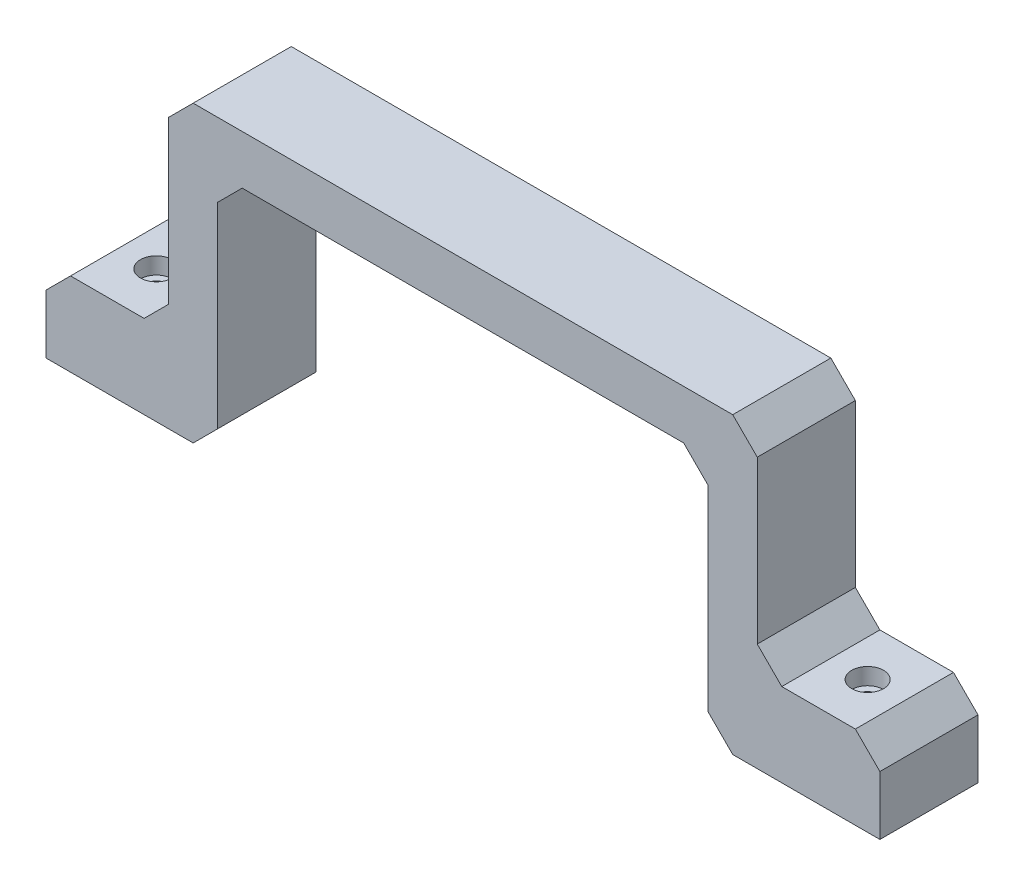
ISO-10303-21;
HEADER;
FILE_DESCRIPTION(('STEP AP214'),'2;1');
FILE_NAME('part.step','',(''),(''),'','','');
FILE_SCHEMA(('AUTOMOTIVE_DESIGN { 1 0 10303 214 1 1 1 1 }'));
ENDSEC;
DATA;
#1=APPLICATION_CONTEXT('core data for automotive mechanical design processes');
#2=APPLICATION_PROTOCOL_DEFINITION('international standard','automotive_design',2000,#1);
#3=PRODUCT_CONTEXT('',#1,'mechanical');
#4=PRODUCT('Part','Part','',(#3));
#5=PRODUCT_RELATED_PRODUCT_CATEGORY('part','',(#4));
#6=PRODUCT_DEFINITION_FORMATION('','',#4);
#7=PRODUCT_DEFINITION_CONTEXT('part definition',#1,'design');
#8=PRODUCT_DEFINITION('design','',#6,#7);
#9=PRODUCT_DEFINITION_SHAPE('','',#8);
#10=(LENGTH_UNIT() NAMED_UNIT(*) SI_UNIT(.MILLI.,.METRE.));
#11=(NAMED_UNIT(*) PLANE_ANGLE_UNIT() SI_UNIT($,.RADIAN.));
#12=(NAMED_UNIT(*) SI_UNIT($,.STERADIAN.) SOLID_ANGLE_UNIT());
#13=UNCERTAINTY_MEASURE_WITH_UNIT(LENGTH_MEASURE(1.E-05),#10,'distance_accuracy_value','');
#14=(GEOMETRIC_REPRESENTATION_CONTEXT(3) GLOBAL_UNCERTAINTY_ASSIGNED_CONTEXT((#13)) GLOBAL_UNIT_ASSIGNED_CONTEXT((#10,
#11,#12)) REPRESENTATION_CONTEXT('',''));
#15=CARTESIAN_POINT('',(0.,0.,0.));
#16=DIRECTION('',(0.,0.,1.));
#17=DIRECTION('',(1.,0.,0.));
#18=AXIS2_PLACEMENT_3D('',#15,#16,#17);
#19=CARTESIAN_POINT('',(25.,38.,20.));
#20=DIRECTION('',(-0.707106781186547,0.707106781186548,0.));
#21=DIRECTION('',(-0.707106781186548,-0.707106781186547,0.));
#22=AXIS2_PLACEMENT_3D('',#19,#20,#21);
#23=PLANE('',#22);
#24=DIRECTION('',(0.707106781186548,0.707106781186547,0.));
#25=VECTOR('',#24,1.);
#26=CARTESIAN_POINT('',(25.,38.,0.));
#27=LINE('',#26,#25);
#28=CARTESIAN_POINT('',(25.,38.,0.));
#29=VERTEX_POINT('',#28);
#30=CARTESIAN_POINT('',(30.,43.,0.));
#31=VERTEX_POINT('',#30);
#32=EDGE_CURVE('E231',#29,#31,#27,.T.);
#33=ORIENTED_EDGE('',*,*,#32,.F.);
#34=DIRECTION('',(0.,0.,-1.));
#35=VECTOR('',#34,1.);
#36=CARTESIAN_POINT('',(25.,38.,20.));
#37=LINE('',#36,#35);
#38=CARTESIAN_POINT('',(25.,38.,20.));
#39=VERTEX_POINT('',#38);
#40=EDGE_CURVE('E11',#39,#29,#37,.T.);
#41=ORIENTED_EDGE('',*,*,#40,.F.);
#42=DIRECTION('',(0.707106781186548,0.707106781186547,0.));
#43=VECTOR('',#42,1.);
#44=CARTESIAN_POINT('',(25.,38.,20.));
#45=LINE('',#44,#43);
#46=CARTESIAN_POINT('',(30.,43.,20.));
#47=VERTEX_POINT('',#46);
#48=EDGE_CURVE('E316',#39,#47,#45,.T.);
#49=ORIENTED_EDGE('',*,*,#48,.T.);
#50=DIRECTION('',(0.,0.,-1.));
#51=VECTOR('',#50,1.);
#52=CARTESIAN_POINT('',(30.,43.,20.));
#53=LINE('',#52,#51);
#54=EDGE_CURVE('E47',#47,#31,#53,.T.);
#55=ORIENTED_EDGE('',*,*,#54,.T.);
#56=EDGE_LOOP('',(#33,#41,#49,#55));
#57=FACE_BOUND('',#56,.T.);
#58=ADVANCED_FACE('F44',(#57),#23,.T.);
#59=CARTESIAN_POINT('',(25.,5.,20.));
#60=DIRECTION('',(-1.,0.,0.));
#61=DIRECTION('',(0.,0.,1.));
#62=AXIS2_PLACEMENT_3D('',#59,#60,#61);
#63=PLANE('',#62);
#64=DIRECTION('',(0.,1.,0.));
#65=VECTOR('',#64,1.);
#66=CARTESIAN_POINT('',(25.,5.,0.));
#67=LINE('',#66,#65);
#68=CARTESIAN_POINT('',(25.,5.,0.));
#69=VERTEX_POINT('',#68);
#70=EDGE_CURVE('E313',#69,#29,#67,.T.);
#71=ORIENTED_EDGE('',*,*,#70,.F.);
#72=DIRECTION('',(0.,0.,-1.));
#73=VECTOR('',#72,1.);
#74=CARTESIAN_POINT('',(25.,5.,20.));
#75=LINE('',#74,#73);
#76=CARTESIAN_POINT('',(25.,5.,20.));
#77=VERTEX_POINT('',#76);
#78=EDGE_CURVE('E54',#77,#69,#75,.T.);
#79=ORIENTED_EDGE('',*,*,#78,.F.);
#80=DIRECTION('',(0.,1.,0.));
#81=VECTOR('',#80,1.);
#82=CARTESIAN_POINT('',(25.,5.,20.));
#83=LINE('',#82,#81);
#84=EDGE_CURVE('E217',#77,#39,#83,.T.);
#85=ORIENTED_EDGE('',*,*,#84,.T.);
#86=ORIENTED_EDGE('',*,*,#40,.T.);
#87=EDGE_LOOP('',(#71,#79,#85,#86));
#88=FACE_BOUND('',#87,.T.);
#89=ADVANCED_FACE('F376',(#88),#63,.T.);
#90=CARTESIAN_POINT('',(20.,0.,20.));
#91=DIRECTION('',(-0.707106781186547,0.707106781186548,0.));
#92=DIRECTION('',(-0.707106781186548,-0.707106781186547,0.));
#93=AXIS2_PLACEMENT_3D('',#90,#91,#92);
#94=PLANE('',#93);
#95=DIRECTION('',(0.707106781186548,0.707106781186547,0.));
#96=VECTOR('',#95,1.);
#97=CARTESIAN_POINT('',(20.,0.,0.));
#98=LINE('',#97,#96);
#99=CARTESIAN_POINT('',(20.,0.,0.));
#100=VERTEX_POINT('',#99);
#101=EDGE_CURVE('E203',#100,#69,#98,.T.);
#102=ORIENTED_EDGE('',*,*,#101,.F.);
#103=DIRECTION('',(0.,0.,-1.));
#104=VECTOR('',#103,1.);
#105=CARTESIAN_POINT('',(20.,0.,20.));
#106=LINE('',#105,#104);
#107=CARTESIAN_POINT('',(20.,0.,20.));
#108=VERTEX_POINT('',#107);
#109=EDGE_CURVE('E198',#108,#100,#106,.T.);
#110=ORIENTED_EDGE('',*,*,#109,.F.);
#111=DIRECTION('',(0.707106781186548,0.707106781186547,0.));
#112=VECTOR('',#111,1.);
#113=CARTESIAN_POINT('',(20.,0.,20.));
#114=LINE('',#113,#112);
#115=EDGE_CURVE('E201',#108,#77,#114,.T.);
#116=ORIENTED_EDGE('',*,*,#115,.T.);
#117=ORIENTED_EDGE('',*,*,#78,.T.);
#118=EDGE_LOOP('',(#102,#110,#116,#117));
#119=FACE_BOUND('',#118,.T.);
#120=ADVANCED_FACE('F200',(#119),#94,.T.);
#121=CARTESIAN_POINT('',(5.,0.,20.));
#122=DIRECTION('',(0.,1.,0.));
#123=DIRECTION('',(0.,0.,1.));
#124=AXIS2_PLACEMENT_3D('',#121,#122,#123);
#125=PLANE('',#124);
#126=CARTESIAN_POINT('',(12.5,0.,10.));
#127=DIRECTION('',(0.,1.,0.));
#128=DIRECTION('',(0.,0.,1.));
#129=AXIS2_PLACEMENT_3D('',#126,#127,#128);
#130=CIRCLE('',#129,3.25);
#131=CARTESIAN_POINT('',(12.5,0.,13.25));
#132=VERTEX_POINT('',#131);
#133=EDGE_CURVE('E510',#132,#132,#130,.T.);
#134=ORIENTED_EDGE('',*,*,#133,.F.);
#135=EDGE_LOOP('',(#134));
#136=FACE_BOUND('',#135,.T.);
#137=DIRECTION('',(1.,0.,0.));
#138=VECTOR('',#137,1.);
#139=CARTESIAN_POINT('',(5.,0.,0.));
#140=LINE('',#139,#138);
#141=CARTESIAN_POINT('',(5.,0.,0.));
#142=VERTEX_POINT('',#141);
#143=EDGE_CURVE('E308',#142,#100,#140,.T.);
#144=ORIENTED_EDGE('',*,*,#143,.F.);
#145=DIRECTION('',(0.,0.,-1.));
#146=VECTOR('',#145,1.);
#147=CARTESIAN_POINT('',(5.,0.,20.));
#148=LINE('',#147,#146);
#149=CARTESIAN_POINT('',(5.,0.,20.));
#150=VERTEX_POINT('',#149);
#151=EDGE_CURVE('E209',#150,#142,#148,.T.);
#152=ORIENTED_EDGE('',*,*,#151,.F.);
#153=DIRECTION('',(1.,0.,0.));
#154=VECTOR('',#153,1.);
#155=CARTESIAN_POINT('',(5.,0.,20.));
#156=LINE('',#155,#154);
#157=EDGE_CURVE('E215',#150,#108,#156,.T.);
#158=ORIENTED_EDGE('',*,*,#157,.T.);
#159=ORIENTED_EDGE('',*,*,#109,.T.);
#160=EDGE_LOOP('',(#144,#152,#158,#159));
#161=FACE_BOUND('',#160,.T.);
#162=ADVANCED_FACE('F220',(#136,#161),#125,.T.);
#163=CARTESIAN_POINT('',(0.,-5.,20.));
#164=DIRECTION('',(-0.707106781186548,0.707106781186548,0.));
#165=DIRECTION('',(-0.707106781186548,-0.707106781186548,0.));
#166=AXIS2_PLACEMENT_3D('',#163,#164,#165);
#167=PLANE('',#166);
#168=DIRECTION('',(0.707106781186548,0.707106781186548,0.));
#169=VECTOR('',#168,1.);
#170=CARTESIAN_POINT('',(0.,-5.,0.));
#171=LINE('',#170,#169);
#172=CARTESIAN_POINT('',(0.,-5.,0.));
#173=VERTEX_POINT('',#172);
#174=EDGE_CURVE('E304',#173,#142,#171,.T.);
#175=ORIENTED_EDGE('',*,*,#174,.F.);
#176=DIRECTION('',(0.,0.,-1.));
#177=VECTOR('',#176,1.);
#178=CARTESIAN_POINT('',(0.,-5.,20.));
#179=LINE('',#178,#177);
#180=CARTESIAN_POINT('',(0.,-5.,20.));
#181=VERTEX_POINT('',#180);
#182=EDGE_CURVE('E322',#181,#173,#179,.T.);
#183=ORIENTED_EDGE('',*,*,#182,.F.);
#184=DIRECTION('',(0.707106781186548,0.707106781186548,0.));
#185=VECTOR('',#184,1.);
#186=CARTESIAN_POINT('',(0.,-5.,20.));
#187=LINE('',#186,#185);
#188=EDGE_CURVE('E222',#181,#150,#187,.T.);
#189=ORIENTED_EDGE('',*,*,#188,.T.);
#190=ORIENTED_EDGE('',*,*,#151,.T.);
#191=EDGE_LOOP('',(#175,#183,#189,#190));
#192=FACE_BOUND('',#191,.T.);
#193=ADVANCED_FACE('F389',(#192),#167,.T.);
#194=CARTESIAN_POINT('',(0.,-17.,20.));
#195=DIRECTION('',(-1.,0.,0.));
#196=DIRECTION('',(0.,0.,1.));
#197=AXIS2_PLACEMENT_3D('',#194,#195,#196);
#198=PLANE('',#197);
#199=DIRECTION('',(0.,1.,0.));
#200=VECTOR('',#199,1.);
#201=CARTESIAN_POINT('',(0.,-17.,0.));
#202=LINE('',#201,#200);
#203=CARTESIAN_POINT('',(0.,-17.,0.));
#204=VERTEX_POINT('',#203);
#205=EDGE_CURVE('E300',#204,#173,#202,.T.);
#206=ORIENTED_EDGE('',*,*,#205,.F.);
#207=DIRECTION('',(0.,0.,-1.));
#208=VECTOR('',#207,1.);
#209=CARTESIAN_POINT('',(0.,-17.,20.));
#210=LINE('',#209,#208);
#211=CARTESIAN_POINT('',(0.,-17.,20.));
#212=VERTEX_POINT('',#211);
#213=EDGE_CURVE('E325',#212,#204,#210,.T.);
#214=ORIENTED_EDGE('',*,*,#213,.F.);
#215=DIRECTION('',(0.,1.,0.));
#216=VECTOR('',#215,1.);
#217=CARTESIAN_POINT('',(0.,-17.,20.));
#218=LINE('',#217,#216);
#219=EDGE_CURVE('E225',#212,#181,#218,.T.);
#220=ORIENTED_EDGE('',*,*,#219,.T.);
#221=ORIENTED_EDGE('',*,*,#182,.T.);
#222=EDGE_LOOP('',(#206,#214,#220,#221));
#223=FACE_BOUND('',#222,.T.);
#224=ADVANCED_FACE('F393',(#223),#198,.T.);
#225=CARTESIAN_POINT('',(30.,-17.,20.));
#226=DIRECTION('',(0.,-1.,0.));
#227=DIRECTION('',(0.,0.,-1.));
#228=AXIS2_PLACEMENT_3D('',#225,#226,#227);
#229=PLANE('',#228);
#230=CARTESIAN_POINT('',(12.5,-17.,10.));
#231=DIRECTION('',(0.,-1.,0.));
#232=DIRECTION('',(0.,0.,-1.));
#233=AXIS2_PLACEMENT_3D('',#230,#231,#232);
#234=CIRCLE('',#233,1.8);
#235=CARTESIAN_POINT('',(12.5,-17.,8.2));
#236=VERTEX_POINT('',#235);
#237=EDGE_CURVE('E236',#236,#236,#234,.T.);
#238=ORIENTED_EDGE('',*,*,#237,.F.);
#239=EDGE_LOOP('',(#238));
#240=FACE_BOUND('',#239,.T.);
#241=DIRECTION('',(-1.,0.,0.));
#242=VECTOR('',#241,1.);
#243=CARTESIAN_POINT('',(30.,-17.,0.));
#244=LINE('',#243,#242);
#245=CARTESIAN_POINT('',(30.,-17.,0.));
#246=VERTEX_POINT('',#245);
#247=EDGE_CURVE('E296',#246,#204,#244,.T.);
#248=ORIENTED_EDGE('',*,*,#247,.F.);
#249=DIRECTION('',(0.,0.,-1.));
#250=VECTOR('',#249,1.);
#251=CARTESIAN_POINT('',(30.,-17.,20.));
#252=LINE('',#251,#250);
#253=CARTESIAN_POINT('',(30.,-17.,20.));
#254=VERTEX_POINT('',#253);
#255=EDGE_CURVE('E328',#254,#246,#252,.T.);
#256=ORIENTED_EDGE('',*,*,#255,.F.);
#257=DIRECTION('',(-1.,0.,0.));
#258=VECTOR('',#257,1.);
#259=CARTESIAN_POINT('',(30.,-17.,20.));
#260=LINE('',#259,#258);
#261=EDGE_CURVE('E586',#254,#212,#260,.T.);
#262=ORIENTED_EDGE('',*,*,#261,.T.);
#263=ORIENTED_EDGE('',*,*,#213,.T.);
#264=EDGE_LOOP('',(#248,#256,#262,#263));
#265=FACE_BOUND('',#264,.T.);
#266=ADVANCED_FACE('F397',(#240,#265),#229,.T.);
#267=CARTESIAN_POINT('',(35.,-12.,20.));
#268=DIRECTION('',(0.707106781186547,-0.707106781186548,0.));
#269=DIRECTION('',(0.707106781186548,0.707106781186547,0.));
#270=AXIS2_PLACEMENT_3D('',#267,#268,#269);
#271=PLANE('',#270);
#272=DIRECTION('',(-0.707106781186548,-0.707106781186547,0.));
#273=VECTOR('',#272,1.);
#274=CARTESIAN_POINT('',(35.,-12.,0.));
#275=LINE('',#274,#273);
#276=CARTESIAN_POINT('',(35.,-12.,0.));
#277=VERTEX_POINT('',#276);
#278=EDGE_CURVE('E292',#277,#246,#275,.T.);
#279=ORIENTED_EDGE('',*,*,#278,.F.);
#280=DIRECTION('',(0.,0.,-1.));
#281=VECTOR('',#280,1.);
#282=CARTESIAN_POINT('',(35.,-12.,20.));
#283=LINE('',#282,#281);
#284=CARTESIAN_POINT('',(35.,-12.,20.));
#285=VERTEX_POINT('',#284);
#286=EDGE_CURVE('E331',#285,#277,#283,.T.);
#287=ORIENTED_EDGE('',*,*,#286,.F.);
#288=DIRECTION('',(-0.707106781186548,-0.707106781186547,0.));
#289=VECTOR('',#288,1.);
#290=CARTESIAN_POINT('',(35.,-12.,20.));
#291=LINE('',#290,#289);
#292=EDGE_CURVE('E582',#285,#254,#291,.T.);
#293=ORIENTED_EDGE('',*,*,#292,.T.);
#294=ORIENTED_EDGE('',*,*,#255,.T.);
#295=EDGE_LOOP('',(#279,#287,#293,#294));
#296=FACE_BOUND('',#295,.T.);
#297=ADVANCED_FACE('F401',(#296),#271,.T.);
#298=CARTESIAN_POINT('',(35.,28.,20.));
#299=DIRECTION('',(1.,0.,0.));
#300=DIRECTION('',(0.,1.,0.));
#301=AXIS2_PLACEMENT_3D('',#298,#299,#300);
#302=PLANE('',#301);
#303=DIRECTION('',(0.,-1.,0.));
#304=VECTOR('',#303,1.);
#305=CARTESIAN_POINT('',(35.,28.,0.));
#306=LINE('',#305,#304);
#307=CARTESIAN_POINT('',(35.,28.,0.));
#308=VERTEX_POINT('',#307);
#309=EDGE_CURVE('E288',#308,#277,#306,.T.);
#310=ORIENTED_EDGE('',*,*,#309,.F.);
#311=DIRECTION('',(0.,0.,-1.));
#312=VECTOR('',#311,1.);
#313=CARTESIAN_POINT('',(35.,28.,20.));
#314=LINE('',#313,#312);
#315=CARTESIAN_POINT('',(35.,28.,20.));
#316=VERTEX_POINT('',#315);
#317=EDGE_CURVE('E334',#316,#308,#314,.T.);
#318=ORIENTED_EDGE('',*,*,#317,.F.);
#319=DIRECTION('',(0.,-1.,0.));
#320=VECTOR('',#319,1.);
#321=CARTESIAN_POINT('',(35.,28.,20.));
#322=LINE('',#321,#320);
#323=EDGE_CURVE('E578',#316,#285,#322,.T.);
#324=ORIENTED_EDGE('',*,*,#323,.T.);
#325=ORIENTED_EDGE('',*,*,#286,.T.);
#326=EDGE_LOOP('',(#310,#318,#324,#325));
#327=FACE_BOUND('',#326,.T.);
#328=ADVANCED_FACE('F405',(#327),#302,.T.);
#329=CARTESIAN_POINT('',(40.,33.,20.));
#330=DIRECTION('',(0.707106781186548,-0.707106781186548,0.));
#331=DIRECTION('',(0.707106781186548,0.707106781186548,0.));
#332=AXIS2_PLACEMENT_3D('',#329,#330,#331);
#333=PLANE('',#332);
#334=DIRECTION('',(-0.707106781186547,-0.707106781186547,0.));
#335=VECTOR('',#334,1.);
#336=CARTESIAN_POINT('',(40.,33.,0.));
#337=LINE('',#336,#335);
#338=CARTESIAN_POINT('',(40.,33.,0.));
#339=VERTEX_POINT('',#338);
#340=EDGE_CURVE('E284',#339,#308,#337,.T.);
#341=ORIENTED_EDGE('',*,*,#340,.F.);
#342=DIRECTION('',(0.,0.,-1.));
#343=VECTOR('',#342,1.);
#344=CARTESIAN_POINT('',(40.,33.,20.));
#345=LINE('',#344,#343);
#346=CARTESIAN_POINT('',(40.,33.,20.));
#347=VERTEX_POINT('',#346);
#348=EDGE_CURVE('E337',#347,#339,#345,.T.);
#349=ORIENTED_EDGE('',*,*,#348,.F.);
#350=DIRECTION('',(-0.707106781186547,-0.707106781186547,0.));
#351=VECTOR('',#350,1.);
#352=CARTESIAN_POINT('',(40.,33.,20.));
#353=LINE('',#352,#351);
#354=EDGE_CURVE('E574',#347,#316,#353,.T.);
#355=ORIENTED_EDGE('',*,*,#354,.T.);
#356=ORIENTED_EDGE('',*,*,#317,.T.);
#357=EDGE_LOOP('',(#341,#349,#355,#356));
#358=FACE_BOUND('',#357,.T.);
#359=ADVANCED_FACE('F409',(#358),#333,.T.);
#360=CARTESIAN_POINT('',(130.,33.,20.));
#361=DIRECTION('',(0.,-1.,0.));
#362=DIRECTION('',(1.,0.,0.));
#363=AXIS2_PLACEMENT_3D('',#360,#361,#362);
#364=PLANE('',#363);
#365=DIRECTION('',(-1.,0.,0.));
#366=VECTOR('',#365,1.);
#367=CARTESIAN_POINT('',(130.,33.,0.));
#368=LINE('',#367,#366);
#369=CARTESIAN_POINT('',(130.,33.,0.));
#370=VERTEX_POINT('',#369);
#371=EDGE_CURVE('E280',#370,#339,#368,.T.);
#372=ORIENTED_EDGE('',*,*,#371,.F.);
#373=DIRECTION('',(0.,0.,-1.));
#374=VECTOR('',#373,1.);
#375=CARTESIAN_POINT('',(130.,33.,20.));
#376=LINE('',#375,#374);
#377=CARTESIAN_POINT('',(130.,33.,20.));
#378=VERTEX_POINT('',#377);
#379=EDGE_CURVE('E340',#378,#370,#376,.T.);
#380=ORIENTED_EDGE('',*,*,#379,.F.);
#381=DIRECTION('',(-1.,0.,0.));
#382=VECTOR('',#381,1.);
#383=CARTESIAN_POINT('',(130.,33.,20.));
#384=LINE('',#383,#382);
#385=EDGE_CURVE('E570',#378,#347,#384,.T.);
#386=ORIENTED_EDGE('',*,*,#385,.T.);
#387=ORIENTED_EDGE('',*,*,#348,.T.);
#388=EDGE_LOOP('',(#372,#380,#386,#387));
#389=FACE_BOUND('',#388,.T.);
#390=ADVANCED_FACE('F413',(#389),#364,.T.);
#391=CARTESIAN_POINT('',(135.,28.,20.));
#392=DIRECTION('',(-0.707106781186547,-0.707106781186548,0.));
#393=DIRECTION('',(0.707106781186548,-0.707106781186547,0.));
#394=AXIS2_PLACEMENT_3D('',#391,#392,#393);
#395=PLANE('',#394);
#396=DIRECTION('',(-0.707106781186548,0.707106781186547,0.));
#397=VECTOR('',#396,1.);
#398=CARTESIAN_POINT('',(135.,28.,0.));
#399=LINE('',#398,#397);
#400=CARTESIAN_POINT('',(135.,28.,0.));
#401=VERTEX_POINT('',#400);
#402=EDGE_CURVE('E276',#401,#370,#399,.T.);
#403=ORIENTED_EDGE('',*,*,#402,.F.);
#404=DIRECTION('',(0.,0.,-1.));
#405=VECTOR('',#404,1.);
#406=CARTESIAN_POINT('',(135.,28.,20.));
#407=LINE('',#406,#405);
#408=CARTESIAN_POINT('',(135.,28.,20.));
#409=VERTEX_POINT('',#408);
#410=EDGE_CURVE('E343',#409,#401,#407,.T.);
#411=ORIENTED_EDGE('',*,*,#410,.F.);
#412=DIRECTION('',(-0.707106781186548,0.707106781186547,0.));
#413=VECTOR('',#412,1.);
#414=CARTESIAN_POINT('',(135.,28.,20.));
#415=LINE('',#414,#413);
#416=EDGE_CURVE('E566',#409,#378,#415,.T.);
#417=ORIENTED_EDGE('',*,*,#416,.T.);
#418=ORIENTED_EDGE('',*,*,#379,.T.);
#419=EDGE_LOOP('',(#403,#411,#417,#418));
#420=FACE_BOUND('',#419,.T.);
#421=ADVANCED_FACE('F417',(#420),#395,.T.);
#422=CARTESIAN_POINT('',(135.,-12.,20.));
#423=DIRECTION('',(-1.,0.,0.));
#424=DIRECTION('',(0.,0.,1.));
#425=AXIS2_PLACEMENT_3D('',#422,#423,#424);
#426=PLANE('',#425);
#427=DIRECTION('',(0.,1.,0.));
#428=VECTOR('',#427,1.);
#429=CARTESIAN_POINT('',(135.,-12.,0.));
#430=LINE('',#429,#428);
#431=CARTESIAN_POINT('',(135.,-12.,0.));
#432=VERTEX_POINT('',#431);
#433=EDGE_CURVE('E272',#432,#401,#430,.T.);
#434=ORIENTED_EDGE('',*,*,#433,.F.);
#435=DIRECTION('',(0.,0.,-1.));
#436=VECTOR('',#435,1.);
#437=CARTESIAN_POINT('',(135.,-12.,20.));
#438=LINE('',#437,#436);
#439=CARTESIAN_POINT('',(135.,-12.,20.));
#440=VERTEX_POINT('',#439);
#441=EDGE_CURVE('E346',#440,#432,#438,.T.);
#442=ORIENTED_EDGE('',*,*,#441,.F.);
#443=DIRECTION('',(0.,1.,0.));
#444=VECTOR('',#443,1.);
#445=CARTESIAN_POINT('',(135.,-12.,20.));
#446=LINE('',#445,#444);
#447=EDGE_CURVE('E562',#440,#409,#446,.T.);
#448=ORIENTED_EDGE('',*,*,#447,.T.);
#449=ORIENTED_EDGE('',*,*,#410,.T.);
#450=EDGE_LOOP('',(#434,#442,#448,#449));
#451=FACE_BOUND('',#450,.T.);
#452=ADVANCED_FACE('F421',(#451),#426,.T.);
#453=CARTESIAN_POINT('',(140.,-17.,20.));
#454=DIRECTION('',(-0.707106781186547,-0.707106781186548,0.));
#455=DIRECTION('',(0.707106781186548,-0.707106781186547,0.));
#456=AXIS2_PLACEMENT_3D('',#453,#454,#455);
#457=PLANE('',#456);
#458=DIRECTION('',(-0.707106781186548,0.707106781186547,0.));
#459=VECTOR('',#458,1.);
#460=CARTESIAN_POINT('',(140.,-17.,0.));
#461=LINE('',#460,#459);
#462=CARTESIAN_POINT('',(140.,-17.,0.));
#463=VERTEX_POINT('',#462);
#464=EDGE_CURVE('E268',#463,#432,#461,.T.);
#465=ORIENTED_EDGE('',*,*,#464,.F.);
#466=DIRECTION('',(0.,0.,-1.));
#467=VECTOR('',#466,1.);
#468=CARTESIAN_POINT('',(140.,-17.,20.));
#469=LINE('',#468,#467);
#470=CARTESIAN_POINT('',(140.,-17.,20.));
#471=VERTEX_POINT('',#470);
#472=EDGE_CURVE('E349',#471,#463,#469,.T.);
#473=ORIENTED_EDGE('',*,*,#472,.F.);
#474=DIRECTION('',(-0.707106781186548,0.707106781186547,0.));
#475=VECTOR('',#474,1.);
#476=CARTESIAN_POINT('',(140.,-17.,20.));
#477=LINE('',#476,#475);
#478=EDGE_CURVE('E558',#471,#440,#477,.T.);
#479=ORIENTED_EDGE('',*,*,#478,.T.);
#480=ORIENTED_EDGE('',*,*,#441,.T.);
#481=EDGE_LOOP('',(#465,#473,#479,#480));
#482=FACE_BOUND('',#481,.T.);
#483=ADVANCED_FACE('F425',(#482),#457,.T.);
#484=CARTESIAN_POINT('',(170.,-17.,20.));
#485=DIRECTION('',(0.,-1.,0.));
#486=DIRECTION('',(1.,0.,0.));
#487=AXIS2_PLACEMENT_3D('',#484,#485,#486);
#488=PLANE('',#487);
#489=CARTESIAN_POINT('',(157.5,-17.,10.));
#490=DIRECTION('',(0.,-1.,0.));
#491=DIRECTION('',(1.,0.,0.));
#492=AXIS2_PLACEMENT_3D('',#489,#490,#491);
#493=CIRCLE('',#492,1.80000000000001);
#494=CARTESIAN_POINT('',(159.3,-17.,10.));
#495=VERTEX_POINT('',#494);
#496=EDGE_CURVE('E506',#495,#495,#493,.T.);
#497=ORIENTED_EDGE('',*,*,#496,.F.);
#498=EDGE_LOOP('',(#497));
#499=FACE_BOUND('',#498,.T.);
#500=DIRECTION('',(-1.,0.,0.));
#501=VECTOR('',#500,1.);
#502=CARTESIAN_POINT('',(170.,-17.,0.));
#503=LINE('',#502,#501);
#504=CARTESIAN_POINT('',(170.,-17.,0.));
#505=VERTEX_POINT('',#504);
#506=EDGE_CURVE('E264',#505,#463,#503,.T.);
#507=ORIENTED_EDGE('',*,*,#506,.F.);
#508=DIRECTION('',(0.,0.,-1.));
#509=VECTOR('',#508,1.);
#510=CARTESIAN_POINT('',(170.,-17.,20.));
#511=LINE('',#510,#509);
#512=CARTESIAN_POINT('',(170.,-17.,20.));
#513=VERTEX_POINT('',#512);
#514=EDGE_CURVE('E352',#513,#505,#511,.T.);
#515=ORIENTED_EDGE('',*,*,#514,.F.);
#516=DIRECTION('',(-1.,0.,0.));
#517=VECTOR('',#516,1.);
#518=CARTESIAN_POINT('',(170.,-17.,20.));
#519=LINE('',#518,#517);
#520=EDGE_CURVE('E554',#513,#471,#519,.T.);
#521=ORIENTED_EDGE('',*,*,#520,.T.);
#522=ORIENTED_EDGE('',*,*,#472,.T.);
#523=EDGE_LOOP('',(#507,#515,#521,#522));
#524=FACE_BOUND('',#523,.T.);
#525=ADVANCED_FACE('F429',(#499,#524),#488,.T.);
#526=CARTESIAN_POINT('',(170.,-5.,20.));
#527=DIRECTION('',(1.,0.,0.));
#528=DIRECTION('',(0.,0.,-1.));
#529=AXIS2_PLACEMENT_3D('',#526,#527,#528);
#530=PLANE('',#529);
#531=DIRECTION('',(0.,-1.,0.));
#532=VECTOR('',#531,1.);
#533=CARTESIAN_POINT('',(170.,-5.,0.));
#534=LINE('',#533,#532);
#535=CARTESIAN_POINT('',(170.,-5.,0.));
#536=VERTEX_POINT('',#535);
#537=EDGE_CURVE('E260',#536,#505,#534,.T.);
#538=ORIENTED_EDGE('',*,*,#537,.F.);
#539=DIRECTION('',(0.,0.,-1.));
#540=VECTOR('',#539,1.);
#541=CARTESIAN_POINT('',(170.,-5.,20.));
#542=LINE('',#541,#540);
#543=CARTESIAN_POINT('',(170.,-5.,20.));
#544=VERTEX_POINT('',#543);
#545=EDGE_CURVE('E355',#544,#536,#542,.T.);
#546=ORIENTED_EDGE('',*,*,#545,.F.);
#547=DIRECTION('',(0.,-1.,0.));
#548=VECTOR('',#547,1.);
#549=CARTESIAN_POINT('',(170.,-5.,20.));
#550=LINE('',#549,#548);
#551=EDGE_CURVE('E550',#544,#513,#550,.T.);
#552=ORIENTED_EDGE('',*,*,#551,.T.);
#553=ORIENTED_EDGE('',*,*,#514,.T.);
#554=EDGE_LOOP('',(#538,#546,#552,#553));
#555=FACE_BOUND('',#554,.T.);
#556=ADVANCED_FACE('F433',(#555),#530,.T.);
#557=CARTESIAN_POINT('',(165.,0.,20.));
#558=DIRECTION('',(0.707106781186547,0.707106781186548,0.));
#559=DIRECTION('',(-0.707106781186548,0.707106781186547,0.));
#560=AXIS2_PLACEMENT_3D('',#557,#558,#559);
#561=PLANE('',#560);
#562=DIRECTION('',(0.707106781186548,-0.707106781186547,0.));
#563=VECTOR('',#562,1.);
#564=CARTESIAN_POINT('',(165.,0.,0.));
#565=LINE('',#564,#563);
#566=CARTESIAN_POINT('',(165.,0.,0.));
#567=VERTEX_POINT('',#566);
#568=EDGE_CURVE('E256',#567,#536,#565,.T.);
#569=ORIENTED_EDGE('',*,*,#568,.F.);
#570=DIRECTION('',(0.,0.,-1.));
#571=VECTOR('',#570,1.);
#572=CARTESIAN_POINT('',(165.,0.,20.));
#573=LINE('',#572,#571);
#574=CARTESIAN_POINT('',(165.,0.,20.));
#575=VERTEX_POINT('',#574);
#576=EDGE_CURVE('E358',#575,#567,#573,.T.);
#577=ORIENTED_EDGE('',*,*,#576,.F.);
#578=DIRECTION('',(0.707106781186548,-0.707106781186547,0.));
#579=VECTOR('',#578,1.);
#580=CARTESIAN_POINT('',(165.,0.,20.));
#581=LINE('',#580,#579);
#582=EDGE_CURVE('E546',#575,#544,#581,.T.);
#583=ORIENTED_EDGE('',*,*,#582,.T.);
#584=ORIENTED_EDGE('',*,*,#545,.T.);
#585=EDGE_LOOP('',(#569,#577,#583,#584));
#586=FACE_BOUND('',#585,.T.);
#587=ADVANCED_FACE('F437',(#586),#561,.T.);
#588=CARTESIAN_POINT('',(150.,0.,20.));
#589=DIRECTION('',(0.,1.,0.));
#590=DIRECTION('',(0.,0.,1.));
#591=AXIS2_PLACEMENT_3D('',#588,#589,#590);
#592=PLANE('',#591);
#593=CARTESIAN_POINT('',(157.5,0.,10.));
#594=DIRECTION('',(0.,1.,0.));
#595=DIRECTION('',(0.,0.,1.));
#596=AXIS2_PLACEMENT_3D('',#593,#594,#595);
#597=CIRCLE('',#596,3.25);
#598=CARTESIAN_POINT('',(157.5,0.,13.25));
#599=VERTEX_POINT('',#598);
#600=EDGE_CURVE('E496',#599,#599,#597,.T.);
#601=ORIENTED_EDGE('',*,*,#600,.F.);
#602=EDGE_LOOP('',(#601));
#603=FACE_BOUND('',#602,.T.);
#604=DIRECTION('',(1.,0.,0.));
#605=VECTOR('',#604,1.);
#606=CARTESIAN_POINT('',(150.,0.,0.));
#607=LINE('',#606,#605);
#608=CARTESIAN_POINT('',(150.,0.,0.));
#609=VERTEX_POINT('',#608);
#610=EDGE_CURVE('E252',#609,#567,#607,.T.);
#611=ORIENTED_EDGE('',*,*,#610,.F.);
#612=DIRECTION('',(0.,0.,-1.));
#613=VECTOR('',#612,1.);
#614=CARTESIAN_POINT('',(150.,0.,20.));
#615=LINE('',#614,#613);
#616=CARTESIAN_POINT('',(150.,0.,20.));
#617=VERTEX_POINT('',#616);
#618=EDGE_CURVE('E361',#617,#609,#615,.T.);
#619=ORIENTED_EDGE('',*,*,#618,.F.);
#620=DIRECTION('',(1.,0.,0.));
#621=VECTOR('',#620,1.);
#622=CARTESIAN_POINT('',(150.,0.,20.));
#623=LINE('',#622,#621);
#624=EDGE_CURVE('E542',#617,#575,#623,.T.);
#625=ORIENTED_EDGE('',*,*,#624,.T.);
#626=ORIENTED_EDGE('',*,*,#576,.T.);
#627=EDGE_LOOP('',(#611,#619,#625,#626));
#628=FACE_BOUND('',#627,.T.);
#629=ADVANCED_FACE('F441',(#603,#628),#592,.T.);
#630=CARTESIAN_POINT('',(145.,5.,20.));
#631=DIRECTION('',(0.707106781186547,0.707106781186548,0.));
#632=DIRECTION('',(-0.707106781186548,0.707106781186547,0.));
#633=AXIS2_PLACEMENT_3D('',#630,#631,#632);
#634=PLANE('',#633);
#635=DIRECTION('',(0.707106781186548,-0.707106781186547,0.));
#636=VECTOR('',#635,1.);
#637=CARTESIAN_POINT('',(145.,5.,0.));
#638=LINE('',#637,#636);
#639=CARTESIAN_POINT('',(145.,5.,0.));
#640=VERTEX_POINT('',#639);
#641=EDGE_CURVE('E248',#640,#609,#638,.T.);
#642=ORIENTED_EDGE('',*,*,#641,.F.);
#643=DIRECTION('',(0.,0.,-1.));
#644=VECTOR('',#643,1.);
#645=CARTESIAN_POINT('',(145.,5.,20.));
#646=LINE('',#645,#644);
#647=CARTESIAN_POINT('',(145.,5.,20.));
#648=VERTEX_POINT('',#647);
#649=EDGE_CURVE('E364',#648,#640,#646,.T.);
#650=ORIENTED_EDGE('',*,*,#649,.F.);
#651=DIRECTION('',(0.707106781186548,-0.707106781186547,0.));
#652=VECTOR('',#651,1.);
#653=CARTESIAN_POINT('',(145.,5.,20.));
#654=LINE('',#653,#652);
#655=EDGE_CURVE('E538',#648,#617,#654,.T.);
#656=ORIENTED_EDGE('',*,*,#655,.T.);
#657=ORIENTED_EDGE('',*,*,#618,.T.);
#658=EDGE_LOOP('',(#642,#650,#656,#657));
#659=FACE_BOUND('',#658,.T.);
#660=ADVANCED_FACE('F445',(#659),#634,.T.);
#661=CARTESIAN_POINT('',(145.,38.,20.));
#662=DIRECTION('',(1.,0.,0.));
#663=DIRECTION('',(0.,0.,-1.));
#664=AXIS2_PLACEMENT_3D('',#661,#662,#663);
#665=PLANE('',#664);
#666=DIRECTION('',(0.,-1.,0.));
#667=VECTOR('',#666,1.);
#668=CARTESIAN_POINT('',(145.,38.,0.));
#669=LINE('',#668,#667);
#670=CARTESIAN_POINT('',(145.,38.,0.));
#671=VERTEX_POINT('',#670);
#672=EDGE_CURVE('E244',#671,#640,#669,.T.);
#673=ORIENTED_EDGE('',*,*,#672,.F.);
#674=DIRECTION('',(0.,0.,-1.));
#675=VECTOR('',#674,1.);
#676=CARTESIAN_POINT('',(145.,38.,20.));
#677=LINE('',#676,#675);
#678=CARTESIAN_POINT('',(145.,38.,20.));
#679=VERTEX_POINT('',#678);
#680=EDGE_CURVE('E367',#679,#671,#677,.T.);
#681=ORIENTED_EDGE('',*,*,#680,.F.);
#682=DIRECTION('',(0.,-1.,0.));
#683=VECTOR('',#682,1.);
#684=CARTESIAN_POINT('',(145.,38.,20.));
#685=LINE('',#684,#683);
#686=EDGE_CURVE('E534',#679,#648,#685,.T.);
#687=ORIENTED_EDGE('',*,*,#686,.T.);
#688=ORIENTED_EDGE('',*,*,#649,.T.);
#689=EDGE_LOOP('',(#673,#681,#687,#688));
#690=FACE_BOUND('',#689,.T.);
#691=ADVANCED_FACE('F449',(#690),#665,.T.);
#692=CARTESIAN_POINT('',(140.,43.,20.));
#693=DIRECTION('',(0.707106781186547,0.707106781186548,0.));
#694=DIRECTION('',(-0.707106781186548,0.707106781186547,0.));
#695=AXIS2_PLACEMENT_3D('',#692,#693,#694);
#696=PLANE('',#695);
#697=DIRECTION('',(0.707106781186548,-0.707106781186547,0.));
#698=VECTOR('',#697,1.);
#699=CARTESIAN_POINT('',(140.,43.,0.));
#700=LINE('',#699,#698);
#701=CARTESIAN_POINT('',(140.,43.,0.));
#702=VERTEX_POINT('',#701);
#703=EDGE_CURVE('E240',#702,#671,#700,.T.);
#704=ORIENTED_EDGE('',*,*,#703,.F.);
#705=DIRECTION('',(0.,0.,-1.));
#706=VECTOR('',#705,1.);
#707=CARTESIAN_POINT('',(140.,43.,20.));
#708=LINE('',#707,#706);
#709=CARTESIAN_POINT('',(140.,43.,20.));
#710=VERTEX_POINT('',#709);
#711=EDGE_CURVE('E369',#710,#702,#708,.T.);
#712=ORIENTED_EDGE('',*,*,#711,.F.);
#713=DIRECTION('',(0.707106781186548,-0.707106781186547,0.));
#714=VECTOR('',#713,1.);
#715=CARTESIAN_POINT('',(140.,43.,20.));
#716=LINE('',#715,#714);
#717=EDGE_CURVE('E530',#710,#679,#716,.T.);
#718=ORIENTED_EDGE('',*,*,#717,.T.);
#719=ORIENTED_EDGE('',*,*,#680,.T.);
#720=EDGE_LOOP('',(#704,#712,#718,#719));
#721=FACE_BOUND('',#720,.T.);
#722=ADVANCED_FACE('F453',(#721),#696,.T.);
#723=CARTESIAN_POINT('',(30.,43.,20.));
#724=DIRECTION('',(0.,1.,0.));
#725=DIRECTION('',(0.,0.,1.));
#726=AXIS2_PLACEMENT_3D('',#723,#724,#725);
#727=PLANE('',#726);
#728=DIRECTION('',(1.,0.,0.));
#729=VECTOR('',#728,1.);
#730=CARTESIAN_POINT('',(30.,43.,0.));
#731=LINE('',#730,#729);
#732=EDGE_CURVE('E235',#31,#702,#731,.T.);
#733=ORIENTED_EDGE('',*,*,#732,.F.);
#734=ORIENTED_EDGE('',*,*,#54,.F.);
#735=DIRECTION('',(1.,0.,0.));
#736=VECTOR('',#735,1.);
#737=CARTESIAN_POINT('',(30.,43.,20.));
#738=LINE('',#737,#736);
#739=EDGE_CURVE('E527',#47,#710,#738,.T.);
#740=ORIENTED_EDGE('',*,*,#739,.T.);
#741=ORIENTED_EDGE('',*,*,#711,.T.);
#742=EDGE_LOOP('',(#733,#734,#740,#741));
#743=FACE_BOUND('',#742,.T.);
#744=ADVANCED_FACE('F373',(#743),#727,.T.);
#745=CARTESIAN_POINT('',(0.,0.,20.));
#746=DIRECTION('',(0.,0.,-1.));
#747=DIRECTION('',(-1.,0.,0.));
#748=AXIS2_PLACEMENT_3D('',#745,#746,#747);
#749=PLANE('',#748);
#750=ORIENTED_EDGE('',*,*,#48,.F.);
#751=ORIENTED_EDGE('',*,*,#84,.F.);
#752=ORIENTED_EDGE('',*,*,#115,.F.);
#753=ORIENTED_EDGE('',*,*,#157,.F.);
#754=ORIENTED_EDGE('',*,*,#188,.F.);
#755=ORIENTED_EDGE('',*,*,#219,.F.);
#756=ORIENTED_EDGE('',*,*,#261,.F.);
#757=ORIENTED_EDGE('',*,*,#292,.F.);
#758=ORIENTED_EDGE('',*,*,#323,.F.);
#759=ORIENTED_EDGE('',*,*,#354,.F.);
#760=ORIENTED_EDGE('',*,*,#385,.F.);
#761=ORIENTED_EDGE('',*,*,#416,.F.);
#762=ORIENTED_EDGE('',*,*,#447,.F.);
#763=ORIENTED_EDGE('',*,*,#478,.F.);
#764=ORIENTED_EDGE('',*,*,#520,.F.);
#765=ORIENTED_EDGE('',*,*,#551,.F.);
#766=ORIENTED_EDGE('',*,*,#582,.F.);
#767=ORIENTED_EDGE('',*,*,#624,.F.);
#768=ORIENTED_EDGE('',*,*,#655,.F.);
#769=ORIENTED_EDGE('',*,*,#686,.F.);
#770=ORIENTED_EDGE('',*,*,#717,.F.);
#771=ORIENTED_EDGE('',*,*,#739,.F.);
#772=EDGE_LOOP('',(#750,#751,#752,#753,#754,#755,#756,#757,#758,#759,#760,#761,#762,#763,#764,
#765,#766,#767,#768,#769,#770,#771));
#773=FACE_BOUND('',#772,.T.);
#774=ADVANCED_FACE('F213',(#773),#749,.F.);
#775=CARTESIAN_POINT('',(0.,0.,0.));
#776=DIRECTION('',(0.,0.,-1.));
#777=DIRECTION('',(-1.,0.,0.));
#778=AXIS2_PLACEMENT_3D('',#775,#776,#777);
#779=PLANE('',#778);
#780=ORIENTED_EDGE('',*,*,#32,.T.);
#781=ORIENTED_EDGE('',*,*,#732,.T.);
#782=ORIENTED_EDGE('',*,*,#703,.T.);
#783=ORIENTED_EDGE('',*,*,#672,.T.);
#784=ORIENTED_EDGE('',*,*,#641,.T.);
#785=ORIENTED_EDGE('',*,*,#610,.T.);
#786=ORIENTED_EDGE('',*,*,#568,.T.);
#787=ORIENTED_EDGE('',*,*,#537,.T.);
#788=ORIENTED_EDGE('',*,*,#506,.T.);
#789=ORIENTED_EDGE('',*,*,#464,.T.);
#790=ORIENTED_EDGE('',*,*,#433,.T.);
#791=ORIENTED_EDGE('',*,*,#402,.T.);
#792=ORIENTED_EDGE('',*,*,#371,.T.);
#793=ORIENTED_EDGE('',*,*,#340,.T.);
#794=ORIENTED_EDGE('',*,*,#309,.T.);
#795=ORIENTED_EDGE('',*,*,#278,.T.);
#796=ORIENTED_EDGE('',*,*,#247,.T.);
#797=ORIENTED_EDGE('',*,*,#205,.T.);
#798=ORIENTED_EDGE('',*,*,#174,.T.);
#799=ORIENTED_EDGE('',*,*,#143,.T.);
#800=ORIENTED_EDGE('',*,*,#101,.T.);
#801=ORIENTED_EDGE('',*,*,#70,.T.);
#802=EDGE_LOOP('',(#780,#781,#782,#783,#784,#785,#786,#787,#788,#789,#790,#791,#792,#793,#794,
#795,#796,#797,#798,#799,#800,#801));
#803=FACE_BOUND('',#802,.T.);
#804=ADVANCED_FACE('F375',(#803),#779,.T.);
#805=CARTESIAN_POINT('',(12.5,0.,10.));
#806=DIRECTION('',(0.,1.,0.));
#807=DIRECTION('',(0.,0.,1.));
#808=AXIS2_PLACEMENT_3D('',#805,#806,#807);
#809=CYLINDRICAL_SURFACE('',#808,1.8);
#810=CARTESIAN_POINT('',(12.5,-3.4,10.));
#811=DIRECTION('',(0.,1.,0.));
#812=DIRECTION('',(0.,0.,1.));
#813=AXIS2_PLACEMENT_3D('',#810,#811,#812);
#814=CIRCLE('',#813,1.80000000000001);
#815=CARTESIAN_POINT('',(12.5,-3.4,11.8));
#816=VERTEX_POINT('',#815);
#817=EDGE_CURVE('E518',#816,#816,#814,.T.);
#818=ORIENTED_EDGE('',*,*,#817,.T.);
#819=EDGE_LOOP('',(#818));
#820=FACE_BOUND('',#819,.T.);
#821=ORIENTED_EDGE('',*,*,#237,.T.);
#822=EDGE_LOOP('',(#821));
#823=FACE_BOUND('',#822,.T.);
#824=ADVANCED_FACE('F464',(#820,#823),#809,.F.);
#825=CARTESIAN_POINT('',(14.3,-3.4,10.));
#826=DIRECTION('',(0.,-1.,0.));
#827=DIRECTION('',(0.,0.,-1.));
#828=AXIS2_PLACEMENT_3D('',#825,#826,#827);
#829=PLANE('',#828);
#830=ORIENTED_EDGE('',*,*,#817,.F.);
#831=EDGE_LOOP('',(#830));
#832=FACE_BOUND('',#831,.T.);
#833=CARTESIAN_POINT('',(12.5,-3.4,10.));
#834=DIRECTION('',(0.,1.,0.));
#835=DIRECTION('',(0.,0.,1.));
#836=AXIS2_PLACEMENT_3D('',#833,#834,#835);
#837=CIRCLE('',#836,3.25);
#838=CARTESIAN_POINT('',(12.5,-3.4,13.25));
#839=VERTEX_POINT('',#838);
#840=EDGE_CURVE('E514',#839,#839,#837,.T.);
#841=ORIENTED_EDGE('',*,*,#840,.T.);
#842=EDGE_LOOP('',(#841));
#843=FACE_BOUND('',#842,.T.);
#844=ADVANCED_FACE('F468',(#832,#843),#829,.F.);
#845=CARTESIAN_POINT('',(12.5,0.,10.));
#846=DIRECTION('',(0.,1.,0.));
#847=DIRECTION('',(0.,0.,1.));
#848=AXIS2_PLACEMENT_3D('',#845,#846,#847);
#849=CYLINDRICAL_SURFACE('',#848,3.25);
#850=ORIENTED_EDGE('',*,*,#840,.F.);
#851=EDGE_LOOP('',(#850));
#852=FACE_BOUND('',#851,.T.);
#853=ORIENTED_EDGE('',*,*,#133,.T.);
#854=EDGE_LOOP('',(#853));
#855=FACE_BOUND('',#854,.T.);
#856=ADVANCED_FACE('F472',(#852,#855),#849,.F.);
#857=CARTESIAN_POINT('',(157.5,0.,10.));
#858=DIRECTION('',(0.,1.,0.));
#859=DIRECTION('',(0.,0.,1.));
#860=AXIS2_PLACEMENT_3D('',#857,#858,#859);
#861=CYLINDRICAL_SURFACE('',#860,1.80000000000001);
#862=CARTESIAN_POINT('',(157.5,-3.4,10.));
#863=DIRECTION('',(0.,1.,0.));
#864=DIRECTION('',(0.,0.,1.));
#865=AXIS2_PLACEMENT_3D('',#862,#863,#864);
#866=CIRCLE('',#865,1.80000000000002);
#867=CARTESIAN_POINT('',(157.5,-3.4,11.8));
#868=VERTEX_POINT('',#867);
#869=EDGE_CURVE('E500',#868,#868,#866,.T.);
#870=ORIENTED_EDGE('',*,*,#869,.T.);
#871=EDGE_LOOP('',(#870));
#872=FACE_BOUND('',#871,.T.);
#873=ORIENTED_EDGE('',*,*,#496,.T.);
#874=EDGE_LOOP('',(#873));
#875=FACE_BOUND('',#874,.T.);
#876=ADVANCED_FACE('F476',(#872,#875),#861,.F.);
#877=CARTESIAN_POINT('',(159.3,-3.4,10.));
#878=DIRECTION('',(0.,-1.,0.));
#879=DIRECTION('',(0.,0.,-1.));
#880=AXIS2_PLACEMENT_3D('',#877,#878,#879);
#881=PLANE('',#880);
#882=ORIENTED_EDGE('',*,*,#869,.F.);
#883=EDGE_LOOP('',(#882));
#884=FACE_BOUND('',#883,.T.);
#885=CARTESIAN_POINT('',(157.5,-3.4,10.));
#886=DIRECTION('',(0.,1.,0.));
#887=DIRECTION('',(0.,0.,1.));
#888=AXIS2_PLACEMENT_3D('',#885,#886,#887);
#889=CIRCLE('',#888,3.25);
#890=CARTESIAN_POINT('',(157.5,-3.4,13.25));
#891=VERTEX_POINT('',#890);
#892=EDGE_CURVE('E493',#891,#891,#889,.T.);
#893=ORIENTED_EDGE('',*,*,#892,.T.);
#894=EDGE_LOOP('',(#893));
#895=FACE_BOUND('',#894,.T.);
#896=ADVANCED_FACE('F480',(#884,#895),#881,.F.);
#897=CARTESIAN_POINT('',(157.5,0.,10.));
#898=DIRECTION('',(0.,1.,0.));
#899=DIRECTION('',(0.,0.,1.));
#900=AXIS2_PLACEMENT_3D('',#897,#898,#899);
#901=CYLINDRICAL_SURFACE('',#900,3.25);
#902=ORIENTED_EDGE('',*,*,#892,.F.);
#903=EDGE_LOOP('',(#902));
#904=FACE_BOUND('',#903,.T.);
#905=ORIENTED_EDGE('',*,*,#600,.T.);
#906=EDGE_LOOP('',(#905));
#907=FACE_BOUND('',#906,.T.);
#908=ADVANCED_FACE('F484',(#904,#907),#901,.F.);
#909=CLOSED_SHELL('',(#58,#89,#120,#162,#193,#224,#266,#297,#328,#359,#390,#421,#452,#483,#525,
#556,#587,#629,#660,#691,#722,#744,#774,#804,#824,#844,#856,#876,#896,#908));
#910=MANIFOLD_SOLID_BREP('B2',#909);
#911=ADVANCED_BREP_SHAPE_REPRESENTATION('',(#18,#910),#14);
#912=SHAPE_DEFINITION_REPRESENTATION(#9,#911);
ENDSEC;
END-ISO-10303-21;
